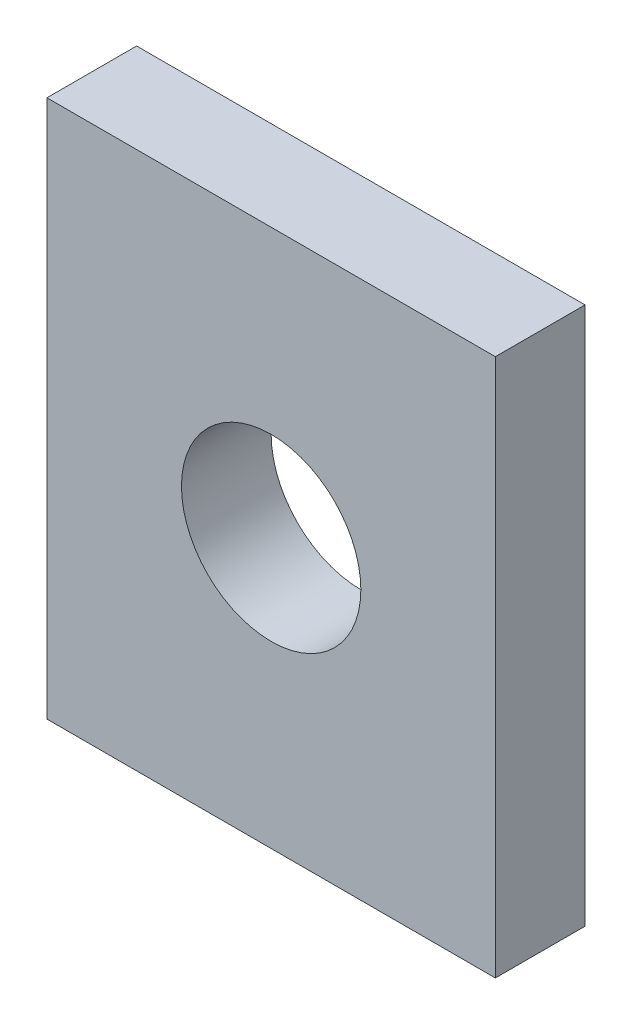
ISO-10303-21;
HEADER;
FILE_DESCRIPTION(('STEP AP214'),'2;1');
FILE_NAME('part.step','',(''),(''),'','','');
FILE_SCHEMA(('AUTOMOTIVE_DESIGN { 1 0 10303 214 1 1 1 1 }'));
ENDSEC;
DATA;
#1=APPLICATION_CONTEXT('core data for automotive mechanical design processes');
#2=APPLICATION_PROTOCOL_DEFINITION('international standard','automotive_design',2000,#1);
#3=PRODUCT_CONTEXT('',#1,'mechanical');
#4=PRODUCT('Part','Part','',(#3));
#5=PRODUCT_RELATED_PRODUCT_CATEGORY('part','',(#4));
#6=PRODUCT_DEFINITION_FORMATION('','',#4);
#7=PRODUCT_DEFINITION_CONTEXT('part definition',#1,'design');
#8=PRODUCT_DEFINITION('design','',#6,#7);
#9=PRODUCT_DEFINITION_SHAPE('','',#8);
#10=(LENGTH_UNIT() NAMED_UNIT(*) SI_UNIT(.MILLI.,.METRE.));
#11=(NAMED_UNIT(*) PLANE_ANGLE_UNIT() SI_UNIT($,.RADIAN.));
#12=(NAMED_UNIT(*) SI_UNIT($,.STERADIAN.) SOLID_ANGLE_UNIT());
#13=UNCERTAINTY_MEASURE_WITH_UNIT(LENGTH_MEASURE(1.E-05),#10,'distance_accuracy_value','');
#14=(GEOMETRIC_REPRESENTATION_CONTEXT(3) GLOBAL_UNCERTAINTY_ASSIGNED_CONTEXT((#13)) GLOBAL_UNIT_ASSIGNED_CONTEXT((#10,
#11,#12)) REPRESENTATION_CONTEXT('',''));
#15=CARTESIAN_POINT('',(0.,0.,0.));
#16=DIRECTION('',(0.,0.,1.));
#17=DIRECTION('',(1.,0.,0.));
#18=AXIS2_PLACEMENT_3D('',#15,#16,#17);
#19=CARTESIAN_POINT('',(25.,232.,20.0000000000002));
#20=DIRECTION('',(-1.,0.,0.));
#21=DIRECTION('',(0.,0.,1.));
#22=AXIS2_PLACEMENT_3D('',#19,#20,#21);
#23=PLANE('',#22);
#24=DIRECTION('',(0.,0.,1.));
#25=VECTOR('',#24,1.);
#26=CARTESIAN_POINT('',(25.,292.,20.0000000000002));
#27=LINE('',#26,#25);
#28=CARTESIAN_POINT('',(25.0000000000001,292.000000000001,10.0000000000001));
#29=VERTEX_POINT('',#28);
#30=CARTESIAN_POINT('',(25.,292.,20.0000000000002));
#31=VERTEX_POINT('',#30);
#32=EDGE_CURVE('E111',#29,#31,#27,.T.);
#33=ORIENTED_EDGE('',*,*,#32,.T.);
#34=DIRECTION('',(0.,1.,0.));
#35=VECTOR('',#34,1.);
#36=CARTESIAN_POINT('',(25.,232.,20.0000000000002));
#37=LINE('',#36,#35);
#38=CARTESIAN_POINT('',(25.,232.,20.0000000000002));
#39=VERTEX_POINT('',#38);
#40=EDGE_CURVE('E11',#39,#31,#37,.T.);
#41=ORIENTED_EDGE('',*,*,#40,.F.);
#42=DIRECTION('',(0.,0.,1.));
#43=VECTOR('',#42,1.);
#44=CARTESIAN_POINT('',(25.,232.,20.0000000000002));
#45=LINE('',#44,#43);
#46=CARTESIAN_POINT('',(25.,232.,10.0000000000001));
#47=VERTEX_POINT('',#46);
#48=EDGE_CURVE('E93',#47,#39,#45,.T.);
#49=ORIENTED_EDGE('',*,*,#48,.F.);
#50=DIRECTION('',(0.,1.,0.));
#51=VECTOR('',#50,1.);
#52=CARTESIAN_POINT('',(25.,232.,10.0000000000001));
#53=LINE('',#52,#51);
#54=EDGE_CURVE('E107',#47,#29,#53,.T.);
#55=ORIENTED_EDGE('',*,*,#54,.T.);
#56=EDGE_LOOP('',(#33,#41,#49,#55));
#57=FACE_BOUND('',#56,.T.);
#58=ADVANCED_FACE('F40',(#57),#23,.F.);
#59=CARTESIAN_POINT('',(25.,232.,20.0000000000002));
#60=DIRECTION('',(0.,0.,-1.));
#61=DIRECTION('',(-1.,0.,0.));
#62=AXIS2_PLACEMENT_3D('',#59,#60,#61);
#63=PLANE('',#62);
#64=CARTESIAN_POINT('',(0.,262.,20.0000000000003));
#65=DIRECTION('',(0.,0.,1.));
#66=DIRECTION('',(0.,-1.,0.));
#67=AXIS2_PLACEMENT_3D('',#64,#65,#66);
#68=CIRCLE('',#67,9.99999999999999);
#69=CARTESIAN_POINT('',(0.,252.,20.0000000000003));
#70=VERTEX_POINT('',#69);
#71=EDGE_CURVE('E134',#70,#70,#68,.T.);
#72=ORIENTED_EDGE('',*,*,#71,.F.);
#73=EDGE_LOOP('',(#72));
#74=FACE_BOUND('',#73,.T.);
#75=DIRECTION('',(-1.,0.,0.));
#76=VECTOR('',#75,1.);
#77=CARTESIAN_POINT('',(25.,292.,20.0000000000002));
#78=LINE('',#77,#76);
#79=CARTESIAN_POINT('',(-25.,292.,20.0000000000002));
#80=VERTEX_POINT('',#79);
#81=EDGE_CURVE('E98',#31,#80,#78,.T.);
#82=ORIENTED_EDGE('',*,*,#81,.T.);
#83=DIRECTION('',(0.,1.,0.));
#84=VECTOR('',#83,1.);
#85=CARTESIAN_POINT('',(-25.,232.,20.));
#86=LINE('',#85,#84);
#87=CARTESIAN_POINT('',(-25.,232.,20.));
#88=VERTEX_POINT('',#87);
#89=EDGE_CURVE('E50',#88,#80,#86,.T.);
#90=ORIENTED_EDGE('',*,*,#89,.F.);
#91=DIRECTION('',(-1.,0.,0.));
#92=VECTOR('',#91,1.);
#93=CARTESIAN_POINT('',(25.,232.,20.0000000000002));
#94=LINE('',#93,#92);
#95=EDGE_CURVE('E88',#39,#88,#94,.T.);
#96=ORIENTED_EDGE('',*,*,#95,.F.);
#97=ORIENTED_EDGE('',*,*,#40,.T.);
#98=EDGE_LOOP('',(#82,#90,#96,#97));
#99=FACE_BOUND('',#98,.T.);
#100=ADVANCED_FACE('F97',(#74,#99),#63,.F.);
#101=CARTESIAN_POINT('',(-25.,232.,10.0000000000001));
#102=DIRECTION('',(1.,0.,0.));
#103=DIRECTION('',(0.,0.,-1.));
#104=AXIS2_PLACEMENT_3D('',#101,#102,#103);
#105=PLANE('',#104);
#106=DIRECTION('',(0.,0.,-1.));
#107=VECTOR('',#106,1.);
#108=CARTESIAN_POINT('',(-25.,292.,10.));
#109=LINE('',#108,#107);
#110=CARTESIAN_POINT('',(-25.,292.,10.));
#111=VERTEX_POINT('',#110);
#112=EDGE_CURVE('E75',#80,#111,#109,.T.);
#113=ORIENTED_EDGE('',*,*,#112,.T.);
#114=DIRECTION('',(0.,1.,0.));
#115=VECTOR('',#114,1.);
#116=CARTESIAN_POINT('',(-25.,232.,10.0000000000001));
#117=LINE('',#116,#115);
#118=CARTESIAN_POINT('',(-25.,232.,10.0000000000001));
#119=VERTEX_POINT('',#118);
#120=EDGE_CURVE('E100',#119,#111,#117,.T.);
#121=ORIENTED_EDGE('',*,*,#120,.F.);
#122=DIRECTION('',(0.,0.,-1.));
#123=VECTOR('',#122,1.);
#124=CARTESIAN_POINT('',(-25.,232.,10.0000000000001));
#125=LINE('',#124,#123);
#126=EDGE_CURVE('E91',#88,#119,#125,.T.);
#127=ORIENTED_EDGE('',*,*,#126,.F.);
#128=ORIENTED_EDGE('',*,*,#89,.T.);
#129=EDGE_LOOP('',(#113,#121,#127,#128));
#130=FACE_BOUND('',#129,.T.);
#131=ADVANCED_FACE('F102',(#130),#105,.F.);
#132=CARTESIAN_POINT('',(25.,232.,10.0000000000001));
#133=DIRECTION('',(0.,0.,1.));
#134=DIRECTION('',(1.,0.,0.));
#135=AXIS2_PLACEMENT_3D('',#132,#133,#134);
#136=PLANE('',#135);
#137=CARTESIAN_POINT('',(0.,262.,10.0000000000003));
#138=DIRECTION('',(0.,0.,1.));
#139=DIRECTION('',(1.,0.,0.));
#140=AXIS2_PLACEMENT_3D('',#137,#138,#139);
#141=CIRCLE('',#140,9.99999999999999);
#142=CARTESIAN_POINT('',(9.99999999999998,262.,10.0000000000004));
#143=VERTEX_POINT('',#142);
#144=EDGE_CURVE('E43',#143,#143,#141,.T.);
#145=ORIENTED_EDGE('',*,*,#144,.T.);
#146=EDGE_LOOP('',(#145));
#147=FACE_BOUND('',#146,.T.);
#148=DIRECTION('',(1.,0.,0.));
#149=VECTOR('',#148,1.);
#150=CARTESIAN_POINT('',(25.0000000000001,292.000000000001,10.0000000000001));
#151=LINE('',#150,#149);
#152=EDGE_CURVE('E81',#111,#29,#151,.T.);
#153=ORIENTED_EDGE('',*,*,#152,.T.);
#154=ORIENTED_EDGE('',*,*,#54,.F.);
#155=DIRECTION('',(1.,0.,0.));
#156=VECTOR('',#155,1.);
#157=CARTESIAN_POINT('',(25.,232.,10.0000000000001));
#158=LINE('',#157,#156);
#159=EDGE_CURVE('E58',#119,#47,#158,.T.);
#160=ORIENTED_EDGE('',*,*,#159,.F.);
#161=ORIENTED_EDGE('',*,*,#120,.T.);
#162=EDGE_LOOP('',(#153,#154,#160,#161));
#163=FACE_BOUND('',#162,.T.);
#164=ADVANCED_FACE('F126',(#147,#163),#136,.F.);
#165=CARTESIAN_POINT('',(25.,232.000000000001,-4.99999999999995));
#166=DIRECTION('',(0.,1.,0.));
#167=DIRECTION('',(0.,0.,1.));
#168=AXIS2_PLACEMENT_3D('',#165,#166,#167);
#169=PLANE('',#168);
#170=ORIENTED_EDGE('',*,*,#48,.T.);
#171=ORIENTED_EDGE('',*,*,#95,.T.);
#172=ORIENTED_EDGE('',*,*,#126,.T.);
#173=ORIENTED_EDGE('',*,*,#159,.T.);
#174=EDGE_LOOP('',(#170,#171,#172,#173));
#175=FACE_BOUND('',#174,.T.);
#176=ADVANCED_FACE('F89',(#175),#169,.F.);
#177=CARTESIAN_POINT('',(25.,292.,-4.99999999999995));
#178=DIRECTION('',(0.,1.,0.));
#179=DIRECTION('',(0.,0.,1.));
#180=AXIS2_PLACEMENT_3D('',#177,#178,#179);
#181=PLANE('',#180);
#182=ORIENTED_EDGE('',*,*,#32,.F.);
#183=ORIENTED_EDGE('',*,*,#152,.F.);
#184=ORIENTED_EDGE('',*,*,#112,.F.);
#185=ORIENTED_EDGE('',*,*,#81,.F.);
#186=EDGE_LOOP('',(#182,#183,#184,#185));
#187=FACE_BOUND('',#186,.T.);
#188=ADVANCED_FACE('F129',(#187),#181,.T.);
#189=CARTESIAN_POINT('',(0.,262.,20.0000000000003));
#190=DIRECTION('',(0.,0.,1.));
#191=DIRECTION('',(0.,-1.,0.));
#192=AXIS2_PLACEMENT_3D('',#189,#190,#191);
#193=CYLINDRICAL_SURFACE('',#192,9.99999999999999);
#194=ORIENTED_EDGE('',*,*,#71,.T.);
#195=EDGE_LOOP('',(#194));
#196=FACE_BOUND('',#195,.T.);
#197=ORIENTED_EDGE('',*,*,#144,.F.);
#198=EDGE_LOOP('',(#197));
#199=FACE_BOUND('',#198,.T.);
#200=ADVANCED_FACE('F145',(#196,#199),#193,.F.);
#201=CLOSED_SHELL('',(#58,#100,#131,#164,#176,#188,#200));
#202=MANIFOLD_SOLID_BREP('B2',#201);
#203=ADVANCED_BREP_SHAPE_REPRESENTATION('',(#18,#202),#14);
#204=SHAPE_DEFINITION_REPRESENTATION(#9,#203);
ENDSEC;
END-ISO-10303-21;
